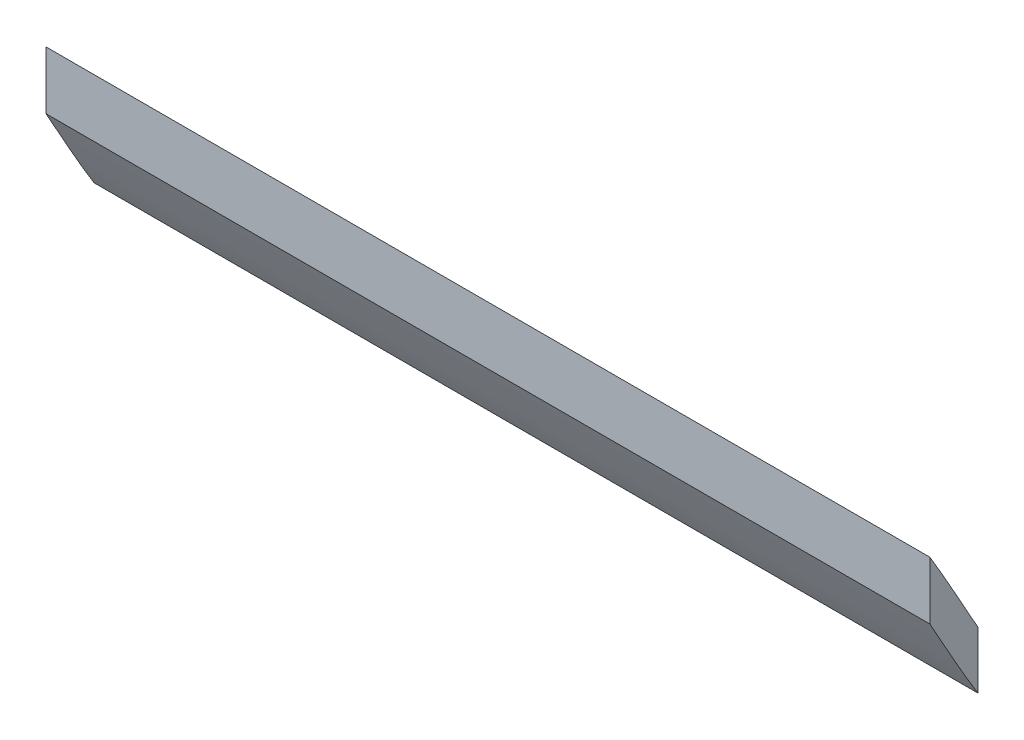
ISO-10303-21;
HEADER;
FILE_DESCRIPTION(('STEP AP214'),'2;1');
FILE_NAME('part.step','',(''),(''),'','','');
FILE_SCHEMA(('AUTOMOTIVE_DESIGN { 1 0 10303 214 1 1 1 1 }'));
ENDSEC;
DATA;
#1=APPLICATION_CONTEXT('core data for automotive mechanical design processes');
#2=APPLICATION_PROTOCOL_DEFINITION('international standard','automotive_design',2000,#1);
#3=PRODUCT_CONTEXT('',#1,'mechanical');
#4=PRODUCT('Part','Part','',(#3));
#5=PRODUCT_RELATED_PRODUCT_CATEGORY('part','',(#4));
#6=PRODUCT_DEFINITION_FORMATION('','',#4);
#7=PRODUCT_DEFINITION_CONTEXT('part definition',#1,'design');
#8=PRODUCT_DEFINITION('design','',#6,#7);
#9=PRODUCT_DEFINITION_SHAPE('','',#8);
#10=(LENGTH_UNIT() NAMED_UNIT(*) SI_UNIT(.MILLI.,.METRE.));
#11=(NAMED_UNIT(*) PLANE_ANGLE_UNIT() SI_UNIT($,.RADIAN.));
#12=(NAMED_UNIT(*) SI_UNIT($,.STERADIAN.) SOLID_ANGLE_UNIT());
#13=UNCERTAINTY_MEASURE_WITH_UNIT(LENGTH_MEASURE(1.E-05),#10,'distance_accuracy_value','');
#14=(GEOMETRIC_REPRESENTATION_CONTEXT(3) GLOBAL_UNCERTAINTY_ASSIGNED_CONTEXT((#13)) GLOBAL_UNIT_ASSIGNED_CONTEXT((#10,
#11,#12)) REPRESENTATION_CONTEXT('',''));
#15=CARTESIAN_POINT('',(0.,0.,0.));
#16=DIRECTION('',(0.,0.,1.));
#17=DIRECTION('',(1.,0.,0.));
#18=AXIS2_PLACEMENT_3D('',#15,#16,#17);
#19=CARTESIAN_POINT('',(55.,-52.3854340963088,91.2973933577945));
#20=CARTESIAN_POINT('',(55.,-51.8639112663879,91.591962100577));
#21=CARTESIAN_POINT('',(55.,-51.3401491716447,91.8831849724433));
#22=CARTESIAN_POINT('',(55.,-49.5701193714384,92.8683482174599));
#23=CARTESIAN_POINT('',(55.,-48.3236157625712,93.5621848194943));
#24=CARTESIAN_POINT('',(55.,-47.1014347739151,94.2973933577945));
#25=B_SPLINE_CURVE_WITH_KNOTS('',3,(#19,#20,#21,#22,#23,#24),.UNSPECIFIED.,.F.,.F.,(4,2,4),
(0.684770993175859,0.749999999999999,0.90531948384867),.UNSPECIFIED.);
#26=DIRECTION('',(-1.,0.,0.));
#27=VECTOR('',#26,1.);
#28=SURFACE_OF_LINEAR_EXTRUSION('',#25,#27);
#29=CARTESIAN_POINT('',(0.,-52.3854340963088,91.2973933577945));
#30=CARTESIAN_POINT('',(0.,-51.8639112663879,91.591962100577));
#31=CARTESIAN_POINT('',(0.,-51.3401491716447,91.8831849724433));
#32=CARTESIAN_POINT('',(0.,-49.5701193714384,92.8683482174599));
#33=CARTESIAN_POINT('',(0.,-48.3236157625712,93.5621848194943));
#34=CARTESIAN_POINT('',(0.,-47.1014347739151,94.2973933577945));
#35=B_SPLINE_CURVE_WITH_KNOTS('',3,(#29,#30,#31,#32,#33,#34),.UNSPECIFIED.,.F.,.F.,(4,2,4),
(0.684770993175859,0.749999999999999,0.90531948384867),.UNSPECIFIED.);
#36=CARTESIAN_POINT('',(0.,-52.3854340963088,91.2973933577945));
#37=VERTEX_POINT('',#36);
#38=CARTESIAN_POINT('',(0.,-47.1014347739151,94.2973933577945));
#39=VERTEX_POINT('',#38);
#40=EDGE_CURVE('E202',#37,#39,#35,.T.);
#41=ORIENTED_EDGE('',*,*,#40,.T.);
#42=DIRECTION('',(-1.,0.,0.));
#43=VECTOR('',#42,1.);
#44=CARTESIAN_POINT('',(55.,-47.1014347739151,94.2973933577945));
#45=LINE('',#44,#43);
#46=CARTESIAN_POINT('',(55.,-47.1014347739151,94.2973933577945));
#47=VERTEX_POINT('',#46);
#48=EDGE_CURVE('E11',#47,#39,#45,.T.);
#49=ORIENTED_EDGE('',*,*,#48,.F.);
#50=CARTESIAN_POINT('',(55.,-47.1014347739151,94.2973933577945));
#51=CARTESIAN_POINT('',(55.,-48.3236157625712,93.5621848194943));
#52=CARTESIAN_POINT('',(55.,-49.5701193714384,92.8683482174599));
#53=CARTESIAN_POINT('',(55.,-51.3401491716447,91.8831849724433));
#54=CARTESIAN_POINT('',(55.,-51.8639112663879,91.591962100577));
#55=CARTESIAN_POINT('',(55.,-52.3854340963088,91.2973933577945));
#56=B_SPLINE_CURVE_WITH_KNOTS('',3,(#50,#51,#52,#53,#54,#55),.UNSPECIFIED.,.F.,.F.,(4,2,4),
(0.684770993175859,0.84009047702453,0.90531948384867),.UNSPECIFIED.);
#57=CARTESIAN_POINT('',(55.,-52.3854340963088,91.2973933577945));
#58=VERTEX_POINT('',#57);
#59=EDGE_CURVE('E99',#58,#47,#56,.F.);
#60=ORIENTED_EDGE('',*,*,#59,.F.);
#61=DIRECTION('',(-1.,0.,0.));
#62=VECTOR('',#61,1.);
#63=CARTESIAN_POINT('',(55.,-52.3854340963088,91.2973933577945));
#64=LINE('',#63,#62);
#65=EDGE_CURVE('E187',#58,#37,#64,.T.);
#66=ORIENTED_EDGE('',*,*,#65,.T.);
#67=EDGE_LOOP('',(#41,#49,#60,#66));
#68=FACE_BOUND('',#67,.T.);
#69=ADVANCED_FACE('F39',(#68),#28,.F.);
#70=CARTESIAN_POINT('',(55.,-47.1014347739151,94.2973933577945));
#71=DIRECTION('',(0.,0.,-1.));
#72=DIRECTION('',(-1.,0.,0.));
#73=AXIS2_PLACEMENT_3D('',#70,#71,#72);
#74=PLANE('',#73);
#75=DIRECTION('',(0.,-1.,0.));
#76=VECTOR('',#75,1.);
#77=CARTESIAN_POINT('',(0.,-47.1014347739151,94.2973933577945));
#78=LINE('',#77,#76);
#79=CARTESIAN_POINT('',(0.,-50.7050615545063,94.2973933577945));
#80=VERTEX_POINT('',#79);
#81=EDGE_CURVE('E105',#39,#80,#78,.T.);
#82=ORIENTED_EDGE('',*,*,#81,.T.);
#83=DIRECTION('',(-1.,0.,0.));
#84=VECTOR('',#83,1.);
#85=CARTESIAN_POINT('',(55.,-50.7050615545063,94.2973933577945));
#86=LINE('',#85,#84);
#87=CARTESIAN_POINT('',(55.,-50.7050615545063,94.2973933577945));
#88=VERTEX_POINT('',#87);
#89=EDGE_CURVE('E53',#88,#80,#86,.T.);
#90=ORIENTED_EDGE('',*,*,#89,.F.);
#91=DIRECTION('',(0.,-1.,0.));
#92=VECTOR('',#91,1.);
#93=CARTESIAN_POINT('',(55.,-47.1014347739151,94.2973933577945));
#94=LINE('',#93,#92);
#95=EDGE_CURVE('E93',#47,#88,#94,.T.);
#96=ORIENTED_EDGE('',*,*,#95,.F.);
#97=ORIENTED_EDGE('',*,*,#48,.T.);
#98=EDGE_LOOP('',(#82,#90,#96,#97));
#99=FACE_BOUND('',#98,.T.);
#100=ADVANCED_FACE('F104',(#99),#74,.F.);
#101=CARTESIAN_POINT('',(55.,-50.7050615545063,94.2973933577945));
#102=CARTESIAN_POINT('',(55.,-51.8120818644211,93.6782392797623));
#103=CARTESIAN_POINT('',(55.,-52.9244155719902,93.0679066065215));
#104=CARTESIAN_POINT('',(55.,-54.6656387899496,92.0661928370281));
#105=CARTESIAN_POINT('',(55.,-55.3032211657094,91.689243802746));
#106=CARTESIAN_POINT('',(55.,-55.9318279732497,91.2973933577945));
#107=B_SPLINE_CURVE_WITH_KNOTS('',3,(#101,#102,#103,#104,#105,#106),.UNSPECIFIED.,.F.,.F.,(4,2,
4),(0.10625854003441,0.250000000000001,0.333977660773738),.UNSPECIFIED.);
#108=DIRECTION('',(-1.,0.,0.));
#109=VECTOR('',#108,1.);
#110=SURFACE_OF_LINEAR_EXTRUSION('',#107,#109);
#111=CARTESIAN_POINT('',(0.,-50.7050615545063,94.2973933577945));
#112=CARTESIAN_POINT('',(0.,-51.8120818644211,93.6782392797623));
#113=CARTESIAN_POINT('',(0.,-52.9244155719902,93.0679066065215));
#114=CARTESIAN_POINT('',(0.,-54.6656387899496,92.0661928370281));
#115=CARTESIAN_POINT('',(0.,-55.3032211657094,91.689243802746));
#116=CARTESIAN_POINT('',(0.,-55.9318279732497,91.2973933577945));
#117=B_SPLINE_CURVE_WITH_KNOTS('',3,(#111,#112,#113,#114,#115,#116),.UNSPECIFIED.,.F.,.F.,(4,2,
4),(0.10625854003441,0.250000000000001,0.333977660773738),.UNSPECIFIED.);
#118=CARTESIAN_POINT('',(0.,-55.9318279732497,91.2973933577945));
#119=VERTEX_POINT('',#118);
#120=EDGE_CURVE('E79',#80,#119,#117,.T.);
#121=ORIENTED_EDGE('',*,*,#120,.T.);
#122=DIRECTION('',(-1.,0.,0.));
#123=VECTOR('',#122,1.);
#124=CARTESIAN_POINT('',(55.,-55.9318279732497,91.2973933577945));
#125=LINE('',#124,#123);
#126=CARTESIAN_POINT('',(55.,-55.9318279732497,91.2973933577945));
#127=VERTEX_POINT('',#126);
#128=EDGE_CURVE('E107',#127,#119,#125,.T.);
#129=ORIENTED_EDGE('',*,*,#128,.F.);
#130=CARTESIAN_POINT('',(55.,-55.9318279732497,91.2973933577945));
#131=CARTESIAN_POINT('',(55.,-55.3032211657094,91.689243802746));
#132=CARTESIAN_POINT('',(55.,-54.6656387899496,92.0661928370281));
#133=CARTESIAN_POINT('',(55.,-52.9244155719902,93.0679066065215));
#134=CARTESIAN_POINT('',(55.,-51.8120818644211,93.6782392797623));
#135=CARTESIAN_POINT('',(55.,-50.7050615545063,94.2973933577945));
#136=B_SPLINE_CURVE_WITH_KNOTS('',3,(#130,#131,#132,#133,#134,#135),.UNSPECIFIED.,.F.,.F.,(4,2,
4),(0.10625854003441,0.190236200808147,0.333977660773738),.UNSPECIFIED.);
#137=EDGE_CURVE('E96',#88,#127,#136,.F.);
#138=ORIENTED_EDGE('',*,*,#137,.F.);
#139=ORIENTED_EDGE('',*,*,#89,.T.);
#140=EDGE_LOOP('',(#121,#129,#138,#139));
#141=FACE_BOUND('',#140,.T.);
#142=ADVANCED_FACE('F110',(#141),#110,.F.);
#143=CARTESIAN_POINT('',(55.,-52.3854340963088,91.2973933577945));
#144=DIRECTION('',(0.,0.,1.));
#145=DIRECTION('',(0.,-1.,0.));
#146=AXIS2_PLACEMENT_3D('',#143,#144,#145);
#147=PLANE('',#146);
#148=DIRECTION('',(0.,1.,0.));
#149=VECTOR('',#148,1.);
#150=CARTESIAN_POINT('',(0.,-52.3854340963088,91.2973933577945));
#151=LINE('',#150,#149);
#152=EDGE_CURVE('E86',#119,#37,#151,.T.);
#153=ORIENTED_EDGE('',*,*,#152,.T.);
#154=ORIENTED_EDGE('',*,*,#65,.F.);
#155=DIRECTION('',(0.,1.,0.));
#156=VECTOR('',#155,1.);
#157=CARTESIAN_POINT('',(55.,-52.3854340963088,91.2973933577945));
#158=LINE('',#157,#156);
#159=EDGE_CURVE('E62',#127,#58,#158,.T.);
#160=ORIENTED_EDGE('',*,*,#159,.F.);
#161=ORIENTED_EDGE('',*,*,#128,.T.);
#162=EDGE_LOOP('',(#153,#154,#160,#161));
#163=FACE_BOUND('',#162,.T.);
#164=ADVANCED_FACE('F130',(#163),#147,.F.);
#165=CARTESIAN_POINT('',(55.,-49.7327049615797,92.7792088660285));
#166=DIRECTION('',(1.,0.,0.));
#167=DIRECTION('',(0.,0.,-1.));
#168=AXIS2_PLACEMENT_3D('',#165,#166,#167);
#169=PLANE('',#168);
#170=ORIENTED_EDGE('',*,*,#59,.T.);
#171=ORIENTED_EDGE('',*,*,#95,.T.);
#172=ORIENTED_EDGE('',*,*,#137,.T.);
#173=ORIENTED_EDGE('',*,*,#159,.T.);
#174=EDGE_LOOP('',(#170,#171,#172,#173));
#175=FACE_BOUND('',#174,.T.);
#176=ADVANCED_FACE('F94',(#175),#169,.T.);
#177=CARTESIAN_POINT('',(0.,-49.7327049615797,92.7792088660285));
#178=DIRECTION('',(1.,0.,0.));
#179=DIRECTION('',(0.,0.,-1.));
#180=AXIS2_PLACEMENT_3D('',#177,#178,#179);
#181=PLANE('',#180);
#182=ORIENTED_EDGE('',*,*,#40,.F.);
#183=ORIENTED_EDGE('',*,*,#152,.F.);
#184=ORIENTED_EDGE('',*,*,#120,.F.);
#185=ORIENTED_EDGE('',*,*,#81,.F.);
#186=EDGE_LOOP('',(#182,#183,#184,#185));
#187=FACE_BOUND('',#186,.T.);
#188=ADVANCED_FACE('F160',(#187),#181,.F.);
#189=CLOSED_SHELL('',(#69,#100,#142,#164,#176,#188));
#190=MANIFOLD_SOLID_BREP('B2',#189);
#191=ADVANCED_BREP_SHAPE_REPRESENTATION('',(#18,#190),#14);
#192=SHAPE_DEFINITION_REPRESENTATION(#9,#191);
ENDSEC;
END-ISO-10303-21;
